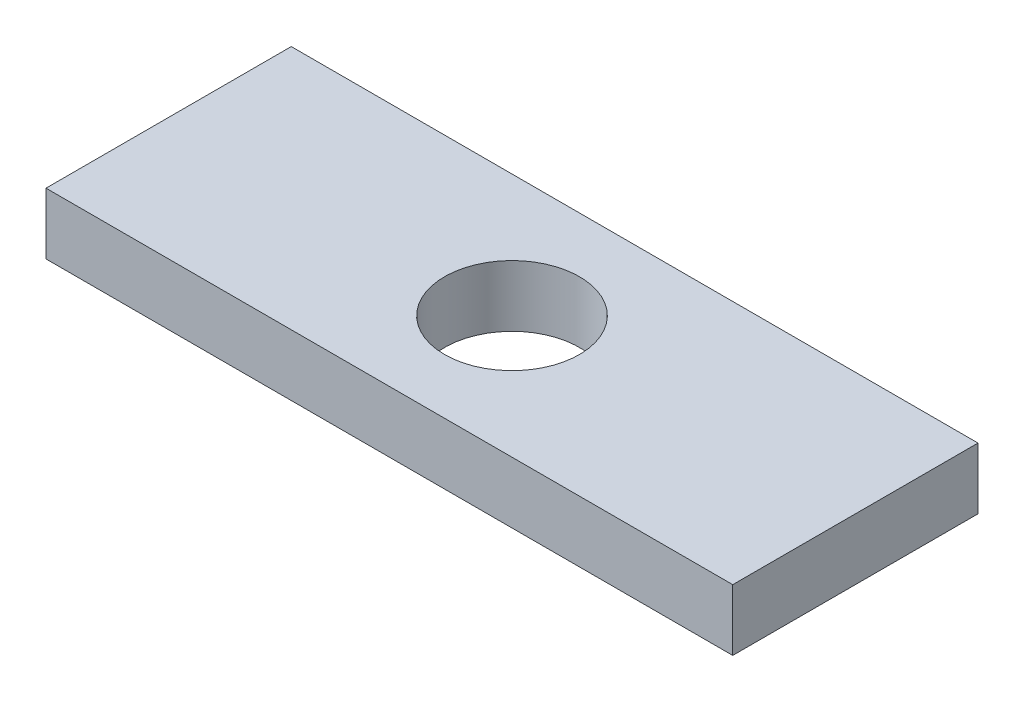
ISO-10303-21;
HEADER;
FILE_DESCRIPTION(('STEP AP214'),'2;1');
FILE_NAME('part.step','',(''),(''),'','','');
FILE_SCHEMA(('AUTOMOTIVE_DESIGN { 1 0 10303 214 1 1 1 1 }'));
ENDSEC;
DATA;
#1=APPLICATION_CONTEXT('core data for automotive mechanical design processes');
#2=APPLICATION_PROTOCOL_DEFINITION('international standard','automotive_design',2000,#1);
#3=PRODUCT_CONTEXT('',#1,'mechanical');
#4=PRODUCT('Part','Part','',(#3));
#5=PRODUCT_RELATED_PRODUCT_CATEGORY('part','',(#4));
#6=PRODUCT_DEFINITION_FORMATION('','',#4);
#7=PRODUCT_DEFINITION_CONTEXT('part definition',#1,'design');
#8=PRODUCT_DEFINITION('design','',#6,#7);
#9=PRODUCT_DEFINITION_SHAPE('','',#8);
#10=(LENGTH_UNIT() NAMED_UNIT(*) SI_UNIT(.MILLI.,.METRE.));
#11=(NAMED_UNIT(*) PLANE_ANGLE_UNIT() SI_UNIT($,.RADIAN.));
#12=(NAMED_UNIT(*) SI_UNIT($,.STERADIAN.) SOLID_ANGLE_UNIT());
#13=UNCERTAINTY_MEASURE_WITH_UNIT(LENGTH_MEASURE(1.E-05),#10,'distance_accuracy_value','');
#14=(GEOMETRIC_REPRESENTATION_CONTEXT(3) GLOBAL_UNCERTAINTY_ASSIGNED_CONTEXT((#13)) GLOBAL_UNIT_ASSIGNED_CONTEXT((#10,
#11,#12)) REPRESENTATION_CONTEXT('',''));
#15=CARTESIAN_POINT('',(0.,0.,0.));
#16=DIRECTION('',(0.,0.,1.));
#17=DIRECTION('',(1.,0.,0.));
#18=AXIS2_PLACEMENT_3D('',#15,#16,#17);
#19=CARTESIAN_POINT('',(0.,3.175,0.));
#20=DIRECTION('',(0.,1.,0.));
#21=DIRECTION('',(0.,0.,1.));
#22=AXIS2_PLACEMENT_3D('',#19,#20,#21);
#23=PLANE('',#22);
#24=DIRECTION('',(0.,0.,1.));
#25=VECTOR('',#24,1.);
#26=CARTESIAN_POINT('',(-17.78,3.175,-6.35));
#27=LINE('',#26,#25);
#28=CARTESIAN_POINT('',(-17.78,3.175,-6.35));
#29=VERTEX_POINT('',#28);
#30=CARTESIAN_POINT('',(-17.78,3.175,6.35));
#31=VERTEX_POINT('',#30);
#32=EDGE_CURVE('E98',#29,#31,#27,.T.);
#33=ORIENTED_EDGE('',*,*,#32,.T.);
#34=DIRECTION('',(1.,0.,0.));
#35=VECTOR('',#34,1.);
#36=CARTESIAN_POINT('',(-17.78,3.175,6.35));
#37=LINE('',#36,#35);
#38=CARTESIAN_POINT('',(17.78,3.175,6.35));
#39=VERTEX_POINT('',#38);
#40=EDGE_CURVE('E90',#31,#39,#37,.T.);
#41=ORIENTED_EDGE('',*,*,#40,.T.);
#42=DIRECTION('',(0.,0.,1.));
#43=VECTOR('',#42,1.);
#44=CARTESIAN_POINT('',(17.78,3.175,-6.35));
#45=LINE('',#44,#43);
#46=CARTESIAN_POINT('',(17.78,3.175,-6.35));
#47=VERTEX_POINT('',#46);
#48=EDGE_CURVE('E97',#47,#39,#45,.T.);
#49=ORIENTED_EDGE('',*,*,#48,.F.);
#50=DIRECTION('',(1.,0.,0.));
#51=VECTOR('',#50,1.);
#52=CARTESIAN_POINT('',(-17.78,3.175,-6.35));
#53=LINE('',#52,#51);
#54=EDGE_CURVE('E107',#29,#47,#53,.T.);
#55=ORIENTED_EDGE('',*,*,#54,.F.);
#56=EDGE_LOOP('',(#33,#41,#49,#55));
#57=FACE_BOUND('',#56,.T.);
#58=CARTESIAN_POINT('',(0.,3.175,0.));
#59=DIRECTION('',(0.,1.,0.));
#60=DIRECTION('',(0.,0.,1.));
#61=AXIS2_PLACEMENT_3D('',#58,#59,#60);
#62=CIRCLE('',#61,3.4925);
#63=CARTESIAN_POINT('',(0.,3.175,3.4925));
#64=VERTEX_POINT('',#63);
#65=EDGE_CURVE('E114',#64,#64,#62,.T.);
#66=ORIENTED_EDGE('',*,*,#65,.F.);
#67=EDGE_LOOP('',(#66));
#68=FACE_BOUND('',#67,.T.);
#69=ADVANCED_FACE('F48',(#57,#68),#23,.T.);
#70=CARTESIAN_POINT('',(0.,0.,0.));
#71=DIRECTION('',(0.,1.,0.));
#72=DIRECTION('',(0.,0.,1.));
#73=AXIS2_PLACEMENT_3D('',#70,#71,#72);
#74=PLANE('',#73);
#75=DIRECTION('',(0.,0.,1.));
#76=VECTOR('',#75,1.);
#77=CARTESIAN_POINT('',(-17.78,0.,-6.35));
#78=LINE('',#77,#76);
#79=CARTESIAN_POINT('',(-17.78,0.,-6.35));
#80=VERTEX_POINT('',#79);
#81=CARTESIAN_POINT('',(-17.78,0.,6.35));
#82=VERTEX_POINT('',#81);
#83=EDGE_CURVE('E112',#80,#82,#78,.T.);
#84=ORIENTED_EDGE('',*,*,#83,.F.);
#85=DIRECTION('',(1.,0.,0.));
#86=VECTOR('',#85,1.);
#87=CARTESIAN_POINT('',(-17.78,0.,-6.35));
#88=LINE('',#87,#86);
#89=CARTESIAN_POINT('',(17.78,0.,-6.35));
#90=VERTEX_POINT('',#89);
#91=EDGE_CURVE('E118',#80,#90,#88,.T.);
#92=ORIENTED_EDGE('',*,*,#91,.T.);
#93=DIRECTION('',(0.,0.,1.));
#94=VECTOR('',#93,1.);
#95=CARTESIAN_POINT('',(17.78,0.,-6.35));
#96=LINE('',#95,#94);
#97=CARTESIAN_POINT('',(17.78,0.,6.35));
#98=VERTEX_POINT('',#97);
#99=EDGE_CURVE('E116',#90,#98,#96,.T.);
#100=ORIENTED_EDGE('',*,*,#99,.T.);
#101=DIRECTION('',(1.,0.,0.));
#102=VECTOR('',#101,1.);
#103=CARTESIAN_POINT('',(-17.78,0.,6.35));
#104=LINE('',#103,#102);
#105=EDGE_CURVE('E103',#82,#98,#104,.T.);
#106=ORIENTED_EDGE('',*,*,#105,.F.);
#107=EDGE_LOOP('',(#84,#92,#100,#106));
#108=FACE_BOUND('',#107,.T.);
#109=CARTESIAN_POINT('',(0.,0.,0.));
#110=DIRECTION('',(0.,1.,0.));
#111=DIRECTION('',(0.,0.,1.));
#112=AXIS2_PLACEMENT_3D('',#109,#110,#111);
#113=CIRCLE('',#112,3.4925);
#114=CARTESIAN_POINT('',(0.,0.,3.4925));
#115=VERTEX_POINT('',#114);
#116=EDGE_CURVE('E124',#115,#115,#113,.T.);
#117=ORIENTED_EDGE('',*,*,#116,.T.);
#118=EDGE_LOOP('',(#117));
#119=FACE_BOUND('',#118,.T.);
#120=ADVANCED_FACE('F133',(#108,#119),#74,.F.);
#121=CARTESIAN_POINT('',(-17.78,3.175,-6.35));
#122=DIRECTION('',(1.,0.,0.));
#123=DIRECTION('',(0.,0.,-1.));
#124=AXIS2_PLACEMENT_3D('',#121,#122,#123);
#125=PLANE('',#124);
#126=ORIENTED_EDGE('',*,*,#83,.T.);
#127=DIRECTION('',(0.,-1.,0.));
#128=VECTOR('',#127,1.);
#129=CARTESIAN_POINT('',(-17.78,3.175,6.35));
#130=LINE('',#129,#128);
#131=EDGE_CURVE('E12',#31,#82,#130,.T.);
#132=ORIENTED_EDGE('',*,*,#131,.F.);
#133=ORIENTED_EDGE('',*,*,#32,.F.);
#134=DIRECTION('',(0.,-1.,0.));
#135=VECTOR('',#134,1.);
#136=CARTESIAN_POINT('',(-17.78,3.175,-6.35));
#137=LINE('',#136,#135);
#138=EDGE_CURVE('E65',#29,#80,#137,.T.);
#139=ORIENTED_EDGE('',*,*,#138,.T.);
#140=EDGE_LOOP('',(#126,#132,#133,#139));
#141=FACE_BOUND('',#140,.T.);
#142=ADVANCED_FACE('F50',(#141),#125,.F.);
#143=CARTESIAN_POINT('',(-17.78,3.175,6.35));
#144=DIRECTION('',(0.,0.,-1.));
#145=DIRECTION('',(-1.,0.,0.));
#146=AXIS2_PLACEMENT_3D('',#143,#144,#145);
#147=PLANE('',#146);
#148=ORIENTED_EDGE('',*,*,#105,.T.);
#149=DIRECTION('',(0.,-1.,0.));
#150=VECTOR('',#149,1.);
#151=CARTESIAN_POINT('',(17.78,3.175,6.35));
#152=LINE('',#151,#150);
#153=EDGE_CURVE('E57',#39,#98,#152,.T.);
#154=ORIENTED_EDGE('',*,*,#153,.F.);
#155=ORIENTED_EDGE('',*,*,#40,.F.);
#156=ORIENTED_EDGE('',*,*,#131,.T.);
#157=EDGE_LOOP('',(#148,#154,#155,#156));
#158=FACE_BOUND('',#157,.T.);
#159=ADVANCED_FACE('F102',(#158),#147,.F.);
#160=CARTESIAN_POINT('',(17.78,3.175,-6.35));
#161=DIRECTION('',(1.,0.,0.));
#162=DIRECTION('',(0.,0.,-1.));
#163=AXIS2_PLACEMENT_3D('',#160,#161,#162);
#164=PLANE('',#163);
#165=ORIENTED_EDGE('',*,*,#99,.F.);
#166=DIRECTION('',(0.,-1.,0.));
#167=VECTOR('',#166,1.);
#168=CARTESIAN_POINT('',(17.78,3.175,-6.35));
#169=LINE('',#168,#167);
#170=EDGE_CURVE('E79',#47,#90,#169,.T.);
#171=ORIENTED_EDGE('',*,*,#170,.F.);
#172=ORIENTED_EDGE('',*,*,#48,.T.);
#173=ORIENTED_EDGE('',*,*,#153,.T.);
#174=EDGE_LOOP('',(#165,#171,#172,#173));
#175=FACE_BOUND('',#174,.T.);
#176=ADVANCED_FACE('F106',(#175),#164,.T.);
#177=CARTESIAN_POINT('',(-17.78,3.175,-6.35));
#178=DIRECTION('',(0.,0.,-1.));
#179=DIRECTION('',(-1.,0.,0.));
#180=AXIS2_PLACEMENT_3D('',#177,#178,#179);
#181=PLANE('',#180);
#182=ORIENTED_EDGE('',*,*,#91,.F.);
#183=ORIENTED_EDGE('',*,*,#138,.F.);
#184=ORIENTED_EDGE('',*,*,#54,.T.);
#185=ORIENTED_EDGE('',*,*,#170,.T.);
#186=EDGE_LOOP('',(#182,#183,#184,#185));
#187=FACE_BOUND('',#186,.T.);
#188=ADVANCED_FACE('F141',(#187),#181,.T.);
#189=CARTESIAN_POINT('',(0.,3.175,0.));
#190=DIRECTION('',(0.,-1.,0.));
#191=DIRECTION('',(0.,0.,-1.));
#192=AXIS2_PLACEMENT_3D('',#189,#190,#191);
#193=CYLINDRICAL_SURFACE('',#192,3.4925);
#194=ORIENTED_EDGE('',*,*,#65,.T.);
#195=EDGE_LOOP('',(#194));
#196=FACE_BOUND('',#195,.T.);
#197=ORIENTED_EDGE('',*,*,#116,.F.);
#198=EDGE_LOOP('',(#197));
#199=FACE_BOUND('',#198,.T.);
#200=ADVANCED_FACE('F130',(#196,#199),#193,.F.);
#201=CLOSED_SHELL('',(#69,#120,#142,#159,#176,#188,#200));
#202=MANIFOLD_SOLID_BREP('B2',#201);
#203=ADVANCED_BREP_SHAPE_REPRESENTATION('',(#18,#202),#14);
#204=SHAPE_DEFINITION_REPRESENTATION(#9,#203);
ENDSEC;
END-ISO-10303-21;
